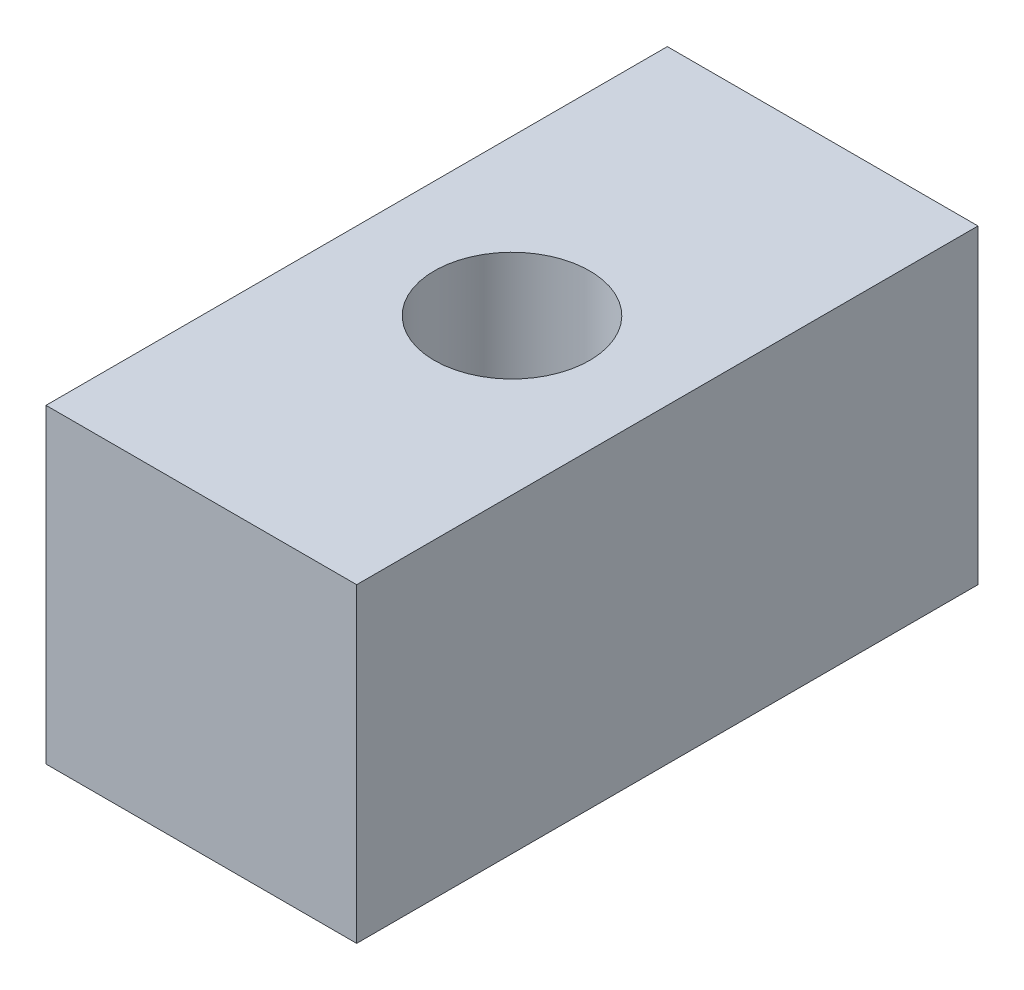
ISO-10303-21;
HEADER;
FILE_DESCRIPTION(('STEP AP214'),'2;1');
FILE_NAME('part.step','',(''),(''),'','','');
FILE_SCHEMA(('AUTOMOTIVE_DESIGN { 1 0 10303 214 1 1 1 1 }'));
ENDSEC;
DATA;
#1=APPLICATION_CONTEXT('core data for automotive mechanical design processes');
#2=APPLICATION_PROTOCOL_DEFINITION('international standard','automotive_design',2000,#1);
#3=PRODUCT_CONTEXT('',#1,'mechanical');
#4=PRODUCT('Part','Part','',(#3));
#5=PRODUCT_RELATED_PRODUCT_CATEGORY('part','',(#4));
#6=PRODUCT_DEFINITION_FORMATION('','',#4);
#7=PRODUCT_DEFINITION_CONTEXT('part definition',#1,'design');
#8=PRODUCT_DEFINITION('design','',#6,#7);
#9=PRODUCT_DEFINITION_SHAPE('','',#8);
#10=(LENGTH_UNIT() NAMED_UNIT(*) SI_UNIT(.MILLI.,.METRE.));
#11=(NAMED_UNIT(*) PLANE_ANGLE_UNIT() SI_UNIT($,.RADIAN.));
#12=(NAMED_UNIT(*) SI_UNIT($,.STERADIAN.) SOLID_ANGLE_UNIT());
#13=UNCERTAINTY_MEASURE_WITH_UNIT(LENGTH_MEASURE(1.E-05),#10,'distance_accuracy_value','');
#14=(GEOMETRIC_REPRESENTATION_CONTEXT(3) GLOBAL_UNCERTAINTY_ASSIGNED_CONTEXT((#13)) GLOBAL_UNIT_ASSIGNED_CONTEXT((#10,
#11,#12)) REPRESENTATION_CONTEXT('',''));
#15=CARTESIAN_POINT('',(0.,0.,0.));
#16=DIRECTION('',(0.,0.,1.));
#17=DIRECTION('',(1.,0.,0.));
#18=AXIS2_PLACEMENT_3D('',#15,#16,#17);
#19=CARTESIAN_POINT('',(-12.7,25.4,25.4));
#20=DIRECTION('',(1.,0.,0.));
#21=DIRECTION('',(0.,0.,-1.));
#22=AXIS2_PLACEMENT_3D('',#19,#20,#21);
#23=PLANE('',#22);
#24=DIRECTION('',(0.,0.,1.));
#25=VECTOR('',#24,1.);
#26=CARTESIAN_POINT('',(-12.7,0.,25.4));
#27=LINE('',#26,#25);
#28=CARTESIAN_POINT('',(-12.7,0.,-25.4));
#29=VERTEX_POINT('',#28);
#30=CARTESIAN_POINT('',(-12.7,0.,25.4));
#31=VERTEX_POINT('',#30);
#32=EDGE_CURVE('E98',#29,#31,#27,.T.);
#33=ORIENTED_EDGE('',*,*,#32,.T.);
#34=DIRECTION('',(0.,-1.,0.));
#35=VECTOR('',#34,1.);
#36=CARTESIAN_POINT('',(-12.7,25.4,25.4));
#37=LINE('',#36,#35);
#38=CARTESIAN_POINT('',(-12.7,25.4,25.4));
#39=VERTEX_POINT('',#38);
#40=EDGE_CURVE('E11',#39,#31,#37,.T.);
#41=ORIENTED_EDGE('',*,*,#40,.F.);
#42=DIRECTION('',(0.,0.,1.));
#43=VECTOR('',#42,1.);
#44=CARTESIAN_POINT('',(-12.7,25.4,25.4));
#45=LINE('',#44,#43);
#46=CARTESIAN_POINT('',(-12.7,25.4,-25.4));
#47=VERTEX_POINT('',#46);
#48=EDGE_CURVE('E86',#47,#39,#45,.T.);
#49=ORIENTED_EDGE('',*,*,#48,.F.);
#50=DIRECTION('',(0.,-1.,0.));
#51=VECTOR('',#50,1.);
#52=CARTESIAN_POINT('',(-12.7,25.4,-25.4));
#53=LINE('',#52,#51);
#54=EDGE_CURVE('E94',#47,#29,#53,.T.);
#55=ORIENTED_EDGE('',*,*,#54,.T.);
#56=EDGE_LOOP('',(#33,#41,#49,#55));
#57=FACE_BOUND('',#56,.T.);
#58=ADVANCED_FACE('F35',(#57),#23,.F.);
#59=CARTESIAN_POINT('',(12.7,25.4,25.4));
#60=DIRECTION('',(0.,0.,-1.));
#61=DIRECTION('',(-1.,0.,0.));
#62=AXIS2_PLACEMENT_3D('',#59,#60,#61);
#63=PLANE('',#62);
#64=DIRECTION('',(1.,0.,0.));
#65=VECTOR('',#64,1.);
#66=CARTESIAN_POINT('',(12.7,0.,25.4));
#67=LINE('',#66,#65);
#68=CARTESIAN_POINT('',(12.7,0.,25.4));
#69=VERTEX_POINT('',#68);
#70=EDGE_CURVE('E90',#31,#69,#67,.T.);
#71=ORIENTED_EDGE('',*,*,#70,.T.);
#72=DIRECTION('',(0.,-1.,0.));
#73=VECTOR('',#72,1.);
#74=CARTESIAN_POINT('',(12.7,25.4,25.4));
#75=LINE('',#74,#73);
#76=CARTESIAN_POINT('',(12.7,25.4,25.4));
#77=VERTEX_POINT('',#76);
#78=EDGE_CURVE('E43',#77,#69,#75,.T.);
#79=ORIENTED_EDGE('',*,*,#78,.F.);
#80=DIRECTION('',(1.,0.,0.));
#81=VECTOR('',#80,1.);
#82=CARTESIAN_POINT('',(12.7,25.4,25.4));
#83=LINE('',#82,#81);
#84=EDGE_CURVE('E81',#39,#77,#83,.T.);
#85=ORIENTED_EDGE('',*,*,#84,.F.);
#86=ORIENTED_EDGE('',*,*,#40,.T.);
#87=EDGE_LOOP('',(#71,#79,#85,#86));
#88=FACE_BOUND('',#87,.T.);
#89=ADVANCED_FACE('F89',(#88),#63,.F.);
#90=CARTESIAN_POINT('',(12.7,25.4,25.4));
#91=DIRECTION('',(-1.,0.,0.));
#92=DIRECTION('',(0.,0.,1.));
#93=AXIS2_PLACEMENT_3D('',#90,#91,#92);
#94=PLANE('',#93);
#95=DIRECTION('',(0.,0.,-1.));
#96=VECTOR('',#95,1.);
#97=CARTESIAN_POINT('',(12.7,0.,25.4));
#98=LINE('',#97,#96);
#99=CARTESIAN_POINT('',(12.7,0.,-25.4));
#100=VERTEX_POINT('',#99);
#101=EDGE_CURVE('E68',#69,#100,#98,.T.);
#102=ORIENTED_EDGE('',*,*,#101,.T.);
#103=DIRECTION('',(0.,-1.,0.));
#104=VECTOR('',#103,1.);
#105=CARTESIAN_POINT('',(12.7,25.4,-25.4));
#106=LINE('',#105,#104);
#107=CARTESIAN_POINT('',(12.7,25.4,-25.4));
#108=VERTEX_POINT('',#107);
#109=EDGE_CURVE('E91',#108,#100,#106,.T.);
#110=ORIENTED_EDGE('',*,*,#109,.F.);
#111=DIRECTION('',(0.,0.,-1.));
#112=VECTOR('',#111,1.);
#113=CARTESIAN_POINT('',(12.7,25.4,25.4));
#114=LINE('',#113,#112);
#115=EDGE_CURVE('E84',#77,#108,#114,.T.);
#116=ORIENTED_EDGE('',*,*,#115,.F.);
#117=ORIENTED_EDGE('',*,*,#78,.T.);
#118=EDGE_LOOP('',(#102,#110,#116,#117));
#119=FACE_BOUND('',#118,.T.);
#120=ADVANCED_FACE('F92',(#119),#94,.F.);
#121=CARTESIAN_POINT('',(12.7,25.4,-25.4));
#122=DIRECTION('',(0.,0.,1.));
#123=DIRECTION('',(1.,0.,0.));
#124=AXIS2_PLACEMENT_3D('',#121,#122,#123);
#125=PLANE('',#124);
#126=DIRECTION('',(-1.,0.,0.));
#127=VECTOR('',#126,1.);
#128=CARTESIAN_POINT('',(12.7,0.,-25.4));
#129=LINE('',#128,#127);
#130=EDGE_CURVE('E74',#100,#29,#129,.T.);
#131=ORIENTED_EDGE('',*,*,#130,.T.);
#132=ORIENTED_EDGE('',*,*,#54,.F.);
#133=DIRECTION('',(-1.,0.,0.));
#134=VECTOR('',#133,1.);
#135=CARTESIAN_POINT('',(12.7,25.4,-25.4));
#136=LINE('',#135,#134);
#137=EDGE_CURVE('E51',#108,#47,#136,.T.);
#138=ORIENTED_EDGE('',*,*,#137,.F.);
#139=ORIENTED_EDGE('',*,*,#109,.T.);
#140=EDGE_LOOP('',(#131,#132,#138,#139));
#141=FACE_BOUND('',#140,.T.);
#142=ADVANCED_FACE('F106',(#141),#125,.F.);
#143=CARTESIAN_POINT('',(0.,25.4,0.));
#144=DIRECTION('',(0.,1.,0.));
#145=DIRECTION('',(0.,0.,1.));
#146=AXIS2_PLACEMENT_3D('',#143,#144,#145);
#147=PLANE('',#146);
#148=CARTESIAN_POINT('',(0.,25.4,0.));
#149=DIRECTION('',(0.,1.,0.));
#150=DIRECTION('',(0.,0.,1.));
#151=AXIS2_PLACEMENT_3D('',#148,#149,#150);
#152=CIRCLE('',#151,6.35);
#153=CARTESIAN_POINT('',(0.,25.4,6.35));
#154=VERTEX_POINT('',#153);
#155=EDGE_CURVE('E114',#154,#154,#152,.T.);
#156=ORIENTED_EDGE('',*,*,#155,.F.);
#157=EDGE_LOOP('',(#156));
#158=FACE_BOUND('',#157,.T.);
#159=ORIENTED_EDGE('',*,*,#48,.T.);
#160=ORIENTED_EDGE('',*,*,#84,.T.);
#161=ORIENTED_EDGE('',*,*,#115,.T.);
#162=ORIENTED_EDGE('',*,*,#137,.T.);
#163=EDGE_LOOP('',(#159,#160,#161,#162));
#164=FACE_BOUND('',#163,.T.);
#165=ADVANCED_FACE('F82',(#158,#164),#147,.T.);
#166=CARTESIAN_POINT('',(0.,0.,0.));
#167=DIRECTION('',(0.,1.,0.));
#168=DIRECTION('',(0.,0.,1.));
#169=AXIS2_PLACEMENT_3D('',#166,#167,#168);
#170=PLANE('',#169);
#171=CARTESIAN_POINT('',(0.,0.,0.));
#172=DIRECTION('',(0.,1.,0.));
#173=DIRECTION('',(0.,0.,1.));
#174=AXIS2_PLACEMENT_3D('',#171,#172,#173);
#175=CIRCLE('',#174,6.35);
#176=CARTESIAN_POINT('',(0.,0.,6.35));
#177=VERTEX_POINT('',#176);
#178=EDGE_CURVE('E101',#177,#177,#175,.F.);
#179=ORIENTED_EDGE('',*,*,#178,.F.);
#180=EDGE_LOOP('',(#179));
#181=FACE_BOUND('',#180,.T.);
#182=ORIENTED_EDGE('',*,*,#32,.F.);
#183=ORIENTED_EDGE('',*,*,#130,.F.);
#184=ORIENTED_EDGE('',*,*,#101,.F.);
#185=ORIENTED_EDGE('',*,*,#70,.F.);
#186=EDGE_LOOP('',(#182,#183,#184,#185));
#187=FACE_BOUND('',#186,.T.);
#188=ADVANCED_FACE('F109',(#181,#187),#170,.F.);
#189=CARTESIAN_POINT('',(0.,-0.001000000000001,0.));
#190=DIRECTION('',(0.,1.,0.));
#191=DIRECTION('',(0.,0.,1.));
#192=AXIS2_PLACEMENT_3D('',#189,#190,#191);
#193=CYLINDRICAL_SURFACE('',#192,6.35);
#194=ORIENTED_EDGE('',*,*,#155,.T.);
#195=EDGE_LOOP('',(#194));
#196=FACE_BOUND('',#195,.T.);
#197=ORIENTED_EDGE('',*,*,#178,.T.);
#198=EDGE_LOOP('',(#197));
#199=FACE_BOUND('',#198,.T.);
#200=ADVANCED_FACE('F118',(#196,#199),#193,.F.);
#201=CLOSED_SHELL('',(#58,#89,#120,#142,#165,#188,#200));
#202=MANIFOLD_SOLID_BREP('B2',#201);
#203=ADVANCED_BREP_SHAPE_REPRESENTATION('',(#18,#202),#14);
#204=SHAPE_DEFINITION_REPRESENTATION(#9,#203);
ENDSEC;
END-ISO-10303-21;
